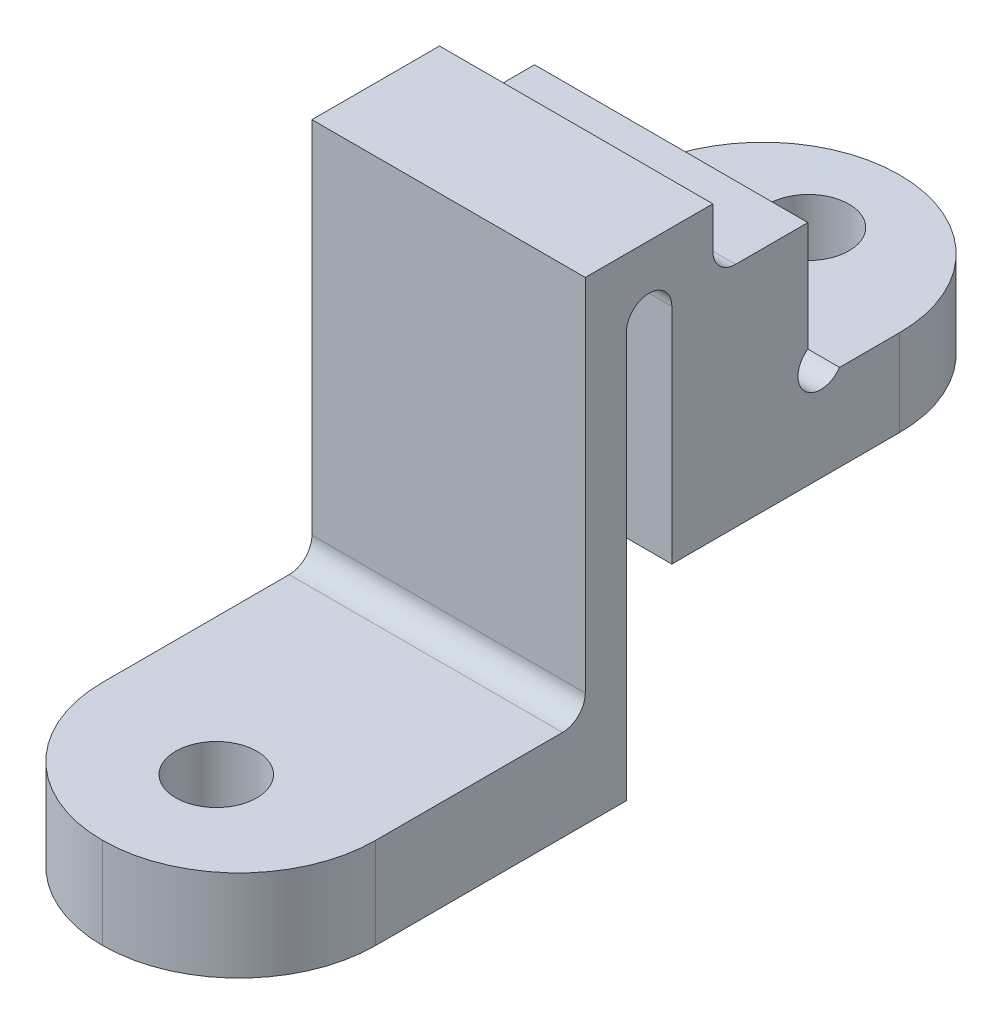
ISO-10303-21;
HEADER;
FILE_DESCRIPTION(('STEP AP214'),'2;1');
FILE_NAME('part.step','',(''),(''),'','','');
FILE_SCHEMA(('AUTOMOTIVE_DESIGN { 1 0 10303 214 1 1 1 1 }'));
ENDSEC;
DATA;
#1=APPLICATION_CONTEXT('core data for automotive mechanical design processes');
#2=APPLICATION_PROTOCOL_DEFINITION('international standard','automotive_design',2000,#1);
#3=PRODUCT_CONTEXT('',#1,'mechanical');
#4=PRODUCT('Part','Part','',(#3));
#5=PRODUCT_RELATED_PRODUCT_CATEGORY('part','',(#4));
#6=PRODUCT_DEFINITION_FORMATION('','',#4);
#7=PRODUCT_DEFINITION_CONTEXT('part definition',#1,'design');
#8=PRODUCT_DEFINITION('design','',#6,#7);
#9=PRODUCT_DEFINITION_SHAPE('','',#8);
#10=(LENGTH_UNIT() NAMED_UNIT(*) SI_UNIT(.MILLI.,.METRE.));
#11=(NAMED_UNIT(*) PLANE_ANGLE_UNIT() SI_UNIT($,.RADIAN.));
#12=(NAMED_UNIT(*) SI_UNIT($,.STERADIAN.) SOLID_ANGLE_UNIT());
#13=UNCERTAINTY_MEASURE_WITH_UNIT(LENGTH_MEASURE(1.E-05),#10,'distance_accuracy_value','');
#14=(GEOMETRIC_REPRESENTATION_CONTEXT(3) GLOBAL_UNCERTAINTY_ASSIGNED_CONTEXT((#13)) GLOBAL_UNIT_ASSIGNED_CONTEXT((#10,
#11,#12)) REPRESENTATION_CONTEXT('',''));
#15=CARTESIAN_POINT('',(0.,0.,0.));
#16=DIRECTION('',(0.,0.,1.));
#17=DIRECTION('',(1.,0.,0.));
#18=AXIS2_PLACEMENT_3D('',#15,#16,#17);
#19=CARTESIAN_POINT('',(1.5,10.597577098778,1.));
#20=DIRECTION('',(0.,-1.,0.));
#21=DIRECTION('',(0.,0.,-1.));
#22=AXIS2_PLACEMENT_3D('',#19,#20,#21);
#23=PLANE('',#22);
#24=CARTESIAN_POINT('',(4.5,10.597577098778,-5.));
#25=DIRECTION('',(0.,-1.,0.));
#26=DIRECTION('',(0.,0.,-1.));
#27=AXIS2_PLACEMENT_3D('',#24,#25,#26);
#28=CIRCLE('',#27,0.888999999999999);
#29=CARTESIAN_POINT('',(4.5,10.597577098778,-5.889));
#30=VERTEX_POINT('',#29);
#31=EDGE_CURVE('E487',#30,#30,#28,.T.);
#32=ORIENTED_EDGE('',*,*,#31,.F.);
#33=EDGE_LOOP('',(#32));
#34=FACE_BOUND('',#33,.T.);
#35=CARTESIAN_POINT('',(4.5,10.597577098778,-4.));
#36=DIRECTION('',(0.,-1.,0.));
#37=DIRECTION('',(0.,0.,-1.));
#38=AXIS2_PLACEMENT_3D('',#35,#36,#37);
#39=CIRCLE('',#38,3.);
#40=CARTESIAN_POINT('',(1.5,10.597577098778,-4.));
#41=VERTEX_POINT('',#40);
#42=CARTESIAN_POINT('',(4.5,10.597577098778,-7.));
#43=VERTEX_POINT('',#42);
#44=EDGE_CURVE('E315',#41,#43,#39,.T.);
#45=ORIENTED_EDGE('',*,*,#44,.T.);
#46=CARTESIAN_POINT('',(4.5,10.597577098778,-4.));
#47=DIRECTION('',(0.,-1.,0.));
#48=DIRECTION('',(0.,0.,-1.));
#49=AXIS2_PLACEMENT_3D('',#46,#47,#48);
#50=CIRCLE('',#49,3.);
#51=CARTESIAN_POINT('',(7.5,10.597577098778,-4.));
#52=VERTEX_POINT('',#51);
#53=EDGE_CURVE('E318',#43,#52,#50,.T.);
#54=ORIENTED_EDGE('',*,*,#53,.T.);
#55=DIRECTION('',(0.,0.,-1.));
#56=VECTOR('',#55,1.);
#57=CARTESIAN_POINT('',(7.5,10.597577098778,1.));
#58=LINE('',#57,#56);
#59=CARTESIAN_POINT('',(7.5,10.597577098778,1.));
#60=VERTEX_POINT('',#59);
#61=EDGE_CURVE('E244',#60,#52,#58,.T.);
#62=ORIENTED_EDGE('',*,*,#61,.F.);
#63=DIRECTION('',(1.,0.,0.));
#64=VECTOR('',#63,1.);
#65=CARTESIAN_POINT('',(1.5,10.597577098778,1.));
#66=LINE('',#65,#64);
#67=CARTESIAN_POINT('',(1.5,10.597577098778,1.));
#68=VERTEX_POINT('',#67);
#69=EDGE_CURVE('E285',#68,#60,#66,.T.);
#70=ORIENTED_EDGE('',*,*,#69,.F.);
#71=DIRECTION('',(0.,0.,-1.));
#72=VECTOR('',#71,1.);
#73=CARTESIAN_POINT('',(1.5,10.597577098778,1.));
#74=LINE('',#73,#72);
#75=EDGE_CURVE('E259',#68,#41,#74,.T.);
#76=ORIENTED_EDGE('',*,*,#75,.T.);
#77=EDGE_LOOP('',(#45,#54,#62,#70,#76));
#78=FACE_BOUND('',#77,.T.);
#79=ADVANCED_FACE('F45',(#34,#78),#23,.T.);
#80=CARTESIAN_POINT('',(1.5,10.597577098778,1.));
#81=DIRECTION('',(0.,0.,1.));
#82=DIRECTION('',(1.,0.,0.));
#83=AXIS2_PLACEMENT_3D('',#80,#81,#82);
#84=PLANE('',#83);
#85=DIRECTION('',(0.,-1.,0.));
#86=VECTOR('',#85,1.);
#87=CARTESIAN_POINT('',(7.5,10.597577098778,1.));
#88=LINE('',#87,#86);
#89=CARTESIAN_POINT('',(7.5,15.497577098778,1.));
#90=VERTEX_POINT('',#89);
#91=EDGE_CURVE('E278',#90,#60,#88,.T.);
#92=ORIENTED_EDGE('',*,*,#91,.F.);
#93=DIRECTION('',(1.,0.,0.));
#94=VECTOR('',#93,1.);
#95=CARTESIAN_POINT('',(1.5,15.497577098778,1.));
#96=LINE('',#95,#94);
#97=CARTESIAN_POINT('',(1.5,15.497577098778,1.));
#98=VERTEX_POINT('',#97);
#99=EDGE_CURVE('E289',#98,#90,#96,.T.);
#100=ORIENTED_EDGE('',*,*,#99,.F.);
#101=DIRECTION('',(0.,-1.,0.));
#102=VECTOR('',#101,1.);
#103=CARTESIAN_POINT('',(1.5,10.597577098778,1.));
#104=LINE('',#103,#102);
#105=EDGE_CURVE('E255',#98,#68,#104,.T.);
#106=ORIENTED_EDGE('',*,*,#105,.T.);
#107=ORIENTED_EDGE('',*,*,#69,.T.);
#108=EDGE_LOOP('',(#92,#100,#106,#107));
#109=FACE_BOUND('',#108,.T.);
#110=ADVANCED_FACE('F416',(#109),#84,.T.);
#111=CARTESIAN_POINT('',(1.5,15.497577098778,1.5));
#112=DIRECTION('',(1.,0.,0.));
#113=DIRECTION('',(0.,0.,-1.));
#114=AXIS2_PLACEMENT_3D('',#111,#112,#113);
#115=CYLINDRICAL_SURFACE('',#114,0.5);
#116=CARTESIAN_POINT('',(7.5,15.497577098778,1.5));
#117=DIRECTION('',(-1.,0.,0.));
#118=DIRECTION('',(0.,0.,1.));
#119=AXIS2_PLACEMENT_3D('',#116,#117,#118);
#120=CIRCLE('',#119,0.5);
#121=CARTESIAN_POINT('',(7.5,15.497577098778,2.));
#122=VERTEX_POINT('',#121);
#123=EDGE_CURVE('E274',#122,#90,#120,.T.);
#124=ORIENTED_EDGE('',*,*,#123,.F.);
#125=DIRECTION('',(1.,0.,0.));
#126=VECTOR('',#125,1.);
#127=CARTESIAN_POINT('',(1.5,15.497577098778,2.));
#128=LINE('',#127,#126);
#129=CARTESIAN_POINT('',(1.5,15.497577098778,2.));
#130=VERTEX_POINT('',#129);
#131=EDGE_CURVE('E292',#130,#122,#128,.T.);
#132=ORIENTED_EDGE('',*,*,#131,.F.);
#133=CARTESIAN_POINT('',(1.5,15.497577098778,1.5));
#134=DIRECTION('',(-1.,0.,0.));
#135=DIRECTION('',(0.,0.,1.));
#136=AXIS2_PLACEMENT_3D('',#133,#134,#135);
#137=CIRCLE('',#136,0.5);
#138=EDGE_CURVE('E251',#130,#98,#137,.T.);
#139=ORIENTED_EDGE('',*,*,#138,.T.);
#140=ORIENTED_EDGE('',*,*,#99,.T.);
#141=EDGE_LOOP('',(#124,#132,#139,#140));
#142=FACE_BOUND('',#141,.T.);
#143=ADVANCED_FACE('F422',(#142),#115,.F.);
#144=CARTESIAN_POINT('',(1.5,6.59757709877801,2.));
#145=DIRECTION('',(0.,0.,-1.));
#146=DIRECTION('',(-1.,0.,0.));
#147=AXIS2_PLACEMENT_3D('',#144,#145,#146);
#148=PLANE('',#147);
#149=DIRECTION('',(0.,1.,0.));
#150=VECTOR('',#149,1.);
#151=CARTESIAN_POINT('',(7.5,6.59757709877801,2.));
#152=LINE('',#151,#150);
#153=CARTESIAN_POINT('',(7.5,6.59757709877801,2.));
#154=VERTEX_POINT('',#153);
#155=EDGE_CURVE('E270',#154,#122,#152,.T.);
#156=ORIENTED_EDGE('',*,*,#155,.F.);
#157=DIRECTION('',(1.,0.,0.));
#158=VECTOR('',#157,1.);
#159=CARTESIAN_POINT('',(1.5,6.59757709877801,2.));
#160=LINE('',#159,#158);
#161=CARTESIAN_POINT('',(1.5,6.59757709877801,2.));
#162=VERTEX_POINT('',#161);
#163=EDGE_CURVE('E263',#162,#154,#160,.T.);
#164=ORIENTED_EDGE('',*,*,#163,.F.);
#165=DIRECTION('',(0.,1.,0.));
#166=VECTOR('',#165,1.);
#167=CARTESIAN_POINT('',(1.5,6.59757709877801,2.));
#168=LINE('',#167,#166);
#169=EDGE_CURVE('E247',#162,#130,#168,.T.);
#170=ORIENTED_EDGE('',*,*,#169,.T.);
#171=ORIENTED_EDGE('',*,*,#131,.T.);
#172=EDGE_LOOP('',(#156,#164,#170,#171));
#173=FACE_BOUND('',#172,.T.);
#174=ADVANCED_FACE('F432',(#173),#148,.T.);
#175=CARTESIAN_POINT('',(1.5,6.59757709877801,10.5));
#176=DIRECTION('',(0.,-1.,0.));
#177=DIRECTION('',(0.,0.,-1.));
#178=AXIS2_PLACEMENT_3D('',#175,#176,#177);
#179=PLANE('',#178);
#180=CARTESIAN_POINT('',(4.5,6.59757709877801,8.));
#181=DIRECTION('',(0.,1.,0.));
#182=DIRECTION('',(0.,0.,1.));
#183=AXIS2_PLACEMENT_3D('',#180,#181,#182);
#184=CIRCLE('',#183,0.888999999999999);
#185=CARTESIAN_POINT('',(4.5,6.59757709877801,8.889));
#186=VERTEX_POINT('',#185);
#187=EDGE_CURVE('E349',#186,#186,#184,.T.);
#188=ORIENTED_EDGE('',*,*,#187,.T.);
#189=EDGE_LOOP('',(#188));
#190=FACE_BOUND('',#189,.T.);
#191=CARTESIAN_POINT('',(4.5,6.59757709877801,7.5));
#192=DIRECTION('',(0.,-1.,0.));
#193=DIRECTION('',(0.,0.,-1.));
#194=AXIS2_PLACEMENT_3D('',#191,#192,#193);
#195=CIRCLE('',#194,3.);
#196=CARTESIAN_POINT('',(7.5,6.59757709877801,7.5));
#197=VERTEX_POINT('',#196);
#198=CARTESIAN_POINT('',(4.5,6.59757709877801,10.5));
#199=VERTEX_POINT('',#198);
#200=EDGE_CURVE('E328',#197,#199,#195,.T.);
#201=ORIENTED_EDGE('',*,*,#200,.T.);
#202=CARTESIAN_POINT('',(4.5,6.59757709877801,7.5));
#203=DIRECTION('',(0.,-1.,0.));
#204=DIRECTION('',(0.,0.,-1.));
#205=AXIS2_PLACEMENT_3D('',#202,#203,#204);
#206=CIRCLE('',#205,3.);
#207=CARTESIAN_POINT('',(1.5,6.59757709877801,7.5));
#208=VERTEX_POINT('',#207);
#209=EDGE_CURVE('E331',#199,#208,#206,.T.);
#210=ORIENTED_EDGE('',*,*,#209,.T.);
#211=DIRECTION('',(0.,0.,-1.));
#212=VECTOR('',#211,1.);
#213=CARTESIAN_POINT('',(1.5,6.59757709877801,10.5));
#214=LINE('',#213,#212);
#215=EDGE_CURVE('E243',#208,#162,#214,.T.);
#216=ORIENTED_EDGE('',*,*,#215,.T.);
#217=ORIENTED_EDGE('',*,*,#163,.T.);
#218=DIRECTION('',(0.,0.,-1.));
#219=VECTOR('',#218,1.);
#220=CARTESIAN_POINT('',(7.5,6.59757709877801,10.5));
#221=LINE('',#220,#219);
#222=EDGE_CURVE('E267',#197,#154,#221,.T.);
#223=ORIENTED_EDGE('',*,*,#222,.F.);
#224=EDGE_LOOP('',(#201,#210,#216,#217,#223));
#225=FACE_BOUND('',#224,.T.);
#226=ADVANCED_FACE('F436',(#190,#225),#179,.T.);
#227=CARTESIAN_POINT('',(1.5,16.997577098778,-7.));
#228=DIRECTION('',(0.,1.,0.));
#229=DIRECTION('',(0.,0.,1.));
#230=AXIS2_PLACEMENT_3D('',#227,#228,#229);
#231=PLANE('',#230);
#232=DIRECTION('',(-1.,0.,0.));
#233=VECTOR('',#232,1.);
#234=CARTESIAN_POINT('',(1.5,16.997577098778,2.9));
#235=LINE('',#234,#233);
#236=CARTESIAN_POINT('',(7.5,16.997577098778,2.9));
#237=VERTEX_POINT('',#236);
#238=CARTESIAN_POINT('',(1.5,16.997577098778,2.9));
#239=VERTEX_POINT('',#238);
#240=EDGE_CURVE('E235',#237,#239,#235,.T.);
#241=ORIENTED_EDGE('',*,*,#240,.F.);
#242=DIRECTION('',(0.,0.,1.));
#243=VECTOR('',#242,1.);
#244=CARTESIAN_POINT('',(7.5,16.997577098778,-7.));
#245=LINE('',#244,#243);
#246=CARTESIAN_POINT('',(7.5,16.997577098778,0.1));
#247=VERTEX_POINT('',#246);
#248=EDGE_CURVE('E238',#247,#237,#245,.T.);
#249=ORIENTED_EDGE('',*,*,#248,.F.);
#250=DIRECTION('',(1.,0.,0.));
#251=VECTOR('',#250,1.);
#252=CARTESIAN_POINT('',(1.5,16.997577098778,0.1));
#253=LINE('',#252,#251);
#254=CARTESIAN_POINT('',(1.5,16.997577098778,0.1));
#255=VERTEX_POINT('',#254);
#256=EDGE_CURVE('E220',#255,#247,#253,.T.);
#257=ORIENTED_EDGE('',*,*,#256,.F.);
#258=DIRECTION('',(0.,0.,1.));
#259=VECTOR('',#258,1.);
#260=CARTESIAN_POINT('',(1.5,16.997577098778,-7.));
#261=LINE('',#260,#259);
#262=EDGE_CURVE('E239',#255,#239,#261,.T.);
#263=ORIENTED_EDGE('',*,*,#262,.T.);
#264=EDGE_LOOP('',(#241,#249,#257,#263));
#265=FACE_BOUND('',#264,.T.);
#266=ADVANCED_FACE('F390',(#265),#231,.T.);
#267=CARTESIAN_POINT('',(1.5,15.497577098778,1.5));
#268=DIRECTION('',(-1.,0.,0.));
#269=DIRECTION('',(0.,0.,1.));
#270=AXIS2_PLACEMENT_3D('',#267,#268,#269);
#271=PLANE('',#270);
#272=CARTESIAN_POINT('',(1.5,12.7804198112526,-2.26914504299253));
#273=DIRECTION('',(1.,0.,0.));
#274=DIRECTION('',(0.,0.,-1.));
#275=AXIS2_PLACEMENT_3D('',#272,#273,#274);
#276=CIRCLE('',#275,0.5);
#277=CARTESIAN_POINT('',(1.5,13.1927303738144,-1.98630233051791));
#278=VERTEX_POINT('',#277);
#279=CARTESIAN_POINT('',(1.5,12.497577098778,-2.6814556055543));
#280=VERTEX_POINT('',#279);
#281=EDGE_CURVE('E178',#278,#280,#276,.T.);
#282=ORIENTED_EDGE('',*,*,#281,.T.);
#283=DIRECTION('',(0.,0.,1.));
#284=VECTOR('',#283,1.);
#285=CARTESIAN_POINT('',(1.5,12.497577098778,-1.98630233051791));
#286=LINE('',#285,#284);
#287=CARTESIAN_POINT('',(1.5,12.497577098778,-4.));
#288=VERTEX_POINT('',#287);
#289=EDGE_CURVE('E210',#288,#280,#286,.T.);
#290=ORIENTED_EDGE('',*,*,#289,.F.);
#291=DIRECTION('',(0.,1.,0.));
#292=VECTOR('',#291,1.);
#293=CARTESIAN_POINT('',(1.5,15.497577098778,-4.));
#294=LINE('',#293,#292);
#295=EDGE_CURVE('E325',#288,#41,#294,.F.);
#296=ORIENTED_EDGE('',*,*,#295,.T.);
#297=ORIENTED_EDGE('',*,*,#75,.F.);
#298=ORIENTED_EDGE('',*,*,#105,.F.);
#299=ORIENTED_EDGE('',*,*,#138,.F.);
#300=ORIENTED_EDGE('',*,*,#169,.F.);
#301=ORIENTED_EDGE('',*,*,#215,.F.);
#302=DIRECTION('',(0.,-1.,0.));
#303=VECTOR('',#302,1.);
#304=CARTESIAN_POINT('',(1.5,15.497577098778,7.5));
#305=LINE('',#304,#303);
#306=CARTESIAN_POINT('',(1.5,8.59757709877801,7.5));
#307=VERTEX_POINT('',#306);
#308=EDGE_CURVE('E321',#208,#307,#305,.F.);
#309=ORIENTED_EDGE('',*,*,#308,.T.);
#310=DIRECTION('',(0.,0.,1.));
#311=VECTOR('',#310,1.);
#312=CARTESIAN_POINT('',(1.5,8.59757709877801,2.9));
#313=LINE('',#312,#311);
#314=CARTESIAN_POINT('',(1.5,8.59757709877801,3.4));
#315=VERTEX_POINT('',#314);
#316=EDGE_CURVE('E204',#315,#307,#313,.T.);
#317=ORIENTED_EDGE('',*,*,#316,.F.);
#318=CARTESIAN_POINT('',(1.5,9.09757709877801,3.4));
#319=DIRECTION('',(-1.,0.,0.));
#320=DIRECTION('',(0.,0.,1.));
#321=AXIS2_PLACEMENT_3D('',#318,#319,#320);
#322=CIRCLE('',#321,0.5);
#323=CARTESIAN_POINT('',(1.5,9.09757709877801,2.9));
#324=VERTEX_POINT('',#323);
#325=EDGE_CURVE('E368',#315,#324,#322,.F.);
#326=ORIENTED_EDGE('',*,*,#325,.T.);
#327=DIRECTION('',(0.,-1.,0.));
#328=VECTOR('',#327,1.);
#329=CARTESIAN_POINT('',(1.5,20.497577098778,2.9));
#330=LINE('',#329,#328);
#331=EDGE_CURVE('E217',#239,#324,#330,.T.);
#332=ORIENTED_EDGE('',*,*,#331,.F.);
#333=ORIENTED_EDGE('',*,*,#262,.F.);
#334=DIRECTION('',(0.,1.,0.));
#335=VECTOR('',#334,1.);
#336=CARTESIAN_POINT('',(1.5,20.497577098778,0.1));
#337=LINE('',#336,#335);
#338=CARTESIAN_POINT('',(1.5,16.097577098778,0.1));
#339=VERTEX_POINT('',#338);
#340=EDGE_CURVE('E224',#339,#255,#337,.T.);
#341=ORIENTED_EDGE('',*,*,#340,.F.);
#342=CARTESIAN_POINT('',(1.5,16.097577098778,-0.4));
#343=DIRECTION('',(-1.,0.,0.));
#344=DIRECTION('',(0.,0.,1.));
#345=AXIS2_PLACEMENT_3D('',#342,#343,#344);
#346=CIRCLE('',#345,0.5);
#347=CARTESIAN_POINT('',(1.5,15.597577098778,-0.4));
#348=VERTEX_POINT('',#347);
#349=EDGE_CURVE('E362',#339,#348,#346,.F.);
#350=ORIENTED_EDGE('',*,*,#349,.T.);
#351=DIRECTION('',(0.,0.,1.));
#352=VECTOR('',#351,1.);
#353=CARTESIAN_POINT('',(1.5,15.597577098778,0.1));
#354=LINE('',#353,#352);
#355=CARTESIAN_POINT('',(1.5,15.597577098778,-1.98630233051791));
#356=VERTEX_POINT('',#355);
#357=EDGE_CURVE('E225',#356,#348,#354,.T.);
#358=ORIENTED_EDGE('',*,*,#357,.F.);
#359=DIRECTION('',(0.,1.,0.));
#360=VECTOR('',#359,1.);
#361=CARTESIAN_POINT('',(1.5,12.497577098778,-1.98630233051791));
#362=LINE('',#361,#360);
#363=EDGE_CURVE('E206',#278,#356,#362,.T.);
#364=ORIENTED_EDGE('',*,*,#363,.F.);
#365=EDGE_LOOP('',(#282,#290,#296,#297,#298,#299,#300,#301,#309,#317,#326,#332,#333,#341,#350,
#358,#364));
#366=FACE_BOUND('',#365,.T.);
#367=ADVANCED_FACE('F384',(#366),#271,.T.);
#368=CARTESIAN_POINT('',(7.5,15.497577098778,1.5));
#369=DIRECTION('',(-1.,0.,0.));
#370=DIRECTION('',(0.,0.,1.));
#371=AXIS2_PLACEMENT_3D('',#368,#369,#370);
#372=PLANE('',#371);
#373=DIRECTION('',(0.,0.,1.));
#374=VECTOR('',#373,1.);
#375=CARTESIAN_POINT('',(7.5,12.497577098778,-1.98630233051791));
#376=LINE('',#375,#374);
#377=CARTESIAN_POINT('',(7.5,12.497577098778,-4.));
#378=VERTEX_POINT('',#377);
#379=CARTESIAN_POINT('',(7.5,12.497577098778,-2.6814556055543));
#380=VERTEX_POINT('',#379);
#381=EDGE_CURVE('E193',#378,#380,#376,.T.);
#382=ORIENTED_EDGE('',*,*,#381,.T.);
#383=CARTESIAN_POINT('',(7.5,12.7804198112526,-2.26914504299253));
#384=DIRECTION('',(1.,0.,0.));
#385=DIRECTION('',(0.,0.,-1.));
#386=AXIS2_PLACEMENT_3D('',#383,#384,#385);
#387=CIRCLE('',#386,0.5);
#388=CARTESIAN_POINT('',(7.5,13.1927303738144,-1.98630233051791));
#389=VERTEX_POINT('',#388);
#390=EDGE_CURVE('E61',#389,#380,#387,.T.);
#391=ORIENTED_EDGE('',*,*,#390,.F.);
#392=DIRECTION('',(0.,1.,0.));
#393=VECTOR('',#392,1.);
#394=CARTESIAN_POINT('',(7.5,12.497577098778,-1.98630233051791));
#395=LINE('',#394,#393);
#396=CARTESIAN_POINT('',(7.5,15.597577098778,-1.98630233051791));
#397=VERTEX_POINT('',#396);
#398=EDGE_CURVE('E189',#389,#397,#395,.T.);
#399=ORIENTED_EDGE('',*,*,#398,.T.);
#400=DIRECTION('',(0.,0.,1.));
#401=VECTOR('',#400,1.);
#402=CARTESIAN_POINT('',(7.5,15.597577098778,1.5));
#403=LINE('',#402,#401);
#404=CARTESIAN_POINT('',(7.5,15.597577098778,-0.4));
#405=VERTEX_POINT('',#404);
#406=EDGE_CURVE('E288',#397,#405,#403,.T.);
#407=ORIENTED_EDGE('',*,*,#406,.T.);
#408=CARTESIAN_POINT('',(7.5,16.097577098778,-0.4));
#409=DIRECTION('',(-1.,0.,0.));
#410=DIRECTION('',(0.,0.,1.));
#411=AXIS2_PLACEMENT_3D('',#408,#409,#410);
#412=CIRCLE('',#411,0.5);
#413=CARTESIAN_POINT('',(7.5,16.097577098778,0.1));
#414=VERTEX_POINT('',#413);
#415=EDGE_CURVE('E365',#405,#414,#412,.T.);
#416=ORIENTED_EDGE('',*,*,#415,.T.);
#417=DIRECTION('',(0.,1.,0.));
#418=VECTOR('',#417,1.);
#419=CARTESIAN_POINT('',(7.5,20.497577098778,0.1));
#420=LINE('',#419,#418);
#421=EDGE_CURVE('E221',#414,#247,#420,.T.);
#422=ORIENTED_EDGE('',*,*,#421,.T.);
#423=ORIENTED_EDGE('',*,*,#248,.T.);
#424=DIRECTION('',(0.,-1.,0.));
#425=VECTOR('',#424,1.);
#426=CARTESIAN_POINT('',(7.5,15.497577098778,2.9));
#427=LINE('',#426,#425);
#428=CARTESIAN_POINT('',(7.5,9.09757709877801,2.9));
#429=VERTEX_POINT('',#428);
#430=EDGE_CURVE('E300',#237,#429,#427,.T.);
#431=ORIENTED_EDGE('',*,*,#430,.T.);
#432=CARTESIAN_POINT('',(7.5,9.09757709877801,3.4));
#433=DIRECTION('',(-1.,0.,0.));
#434=DIRECTION('',(0.,0.,1.));
#435=AXIS2_PLACEMENT_3D('',#432,#433,#434);
#436=CIRCLE('',#435,0.5);
#437=CARTESIAN_POINT('',(7.5,8.59757709877801,3.4));
#438=VERTEX_POINT('',#437);
#439=EDGE_CURVE('E54',#429,#438,#436,.T.);
#440=ORIENTED_EDGE('',*,*,#439,.T.);
#441=DIRECTION('',(0.,0.,1.));
#442=VECTOR('',#441,1.);
#443=CARTESIAN_POINT('',(7.5,8.59757709877801,2.9));
#444=LINE('',#443,#442);
#445=CARTESIAN_POINT('',(7.5,8.59757709877801,7.5));
#446=VERTEX_POINT('',#445);
#447=EDGE_CURVE('E229',#438,#446,#444,.T.);
#448=ORIENTED_EDGE('',*,*,#447,.T.);
#449=DIRECTION('',(0.,-1.,0.));
#450=VECTOR('',#449,1.);
#451=CARTESIAN_POINT('',(7.5,6.59757709877801,7.5));
#452=LINE('',#451,#450);
#453=EDGE_CURVE('E303',#446,#197,#452,.T.);
#454=ORIENTED_EDGE('',*,*,#453,.T.);
#455=ORIENTED_EDGE('',*,*,#222,.T.);
#456=ORIENTED_EDGE('',*,*,#155,.T.);
#457=ORIENTED_EDGE('',*,*,#123,.T.);
#458=ORIENTED_EDGE('',*,*,#91,.T.);
#459=ORIENTED_EDGE('',*,*,#61,.T.);
#460=DIRECTION('',(0.,1.,0.));
#461=VECTOR('',#460,1.);
#462=CARTESIAN_POINT('',(7.5,12.497577098778,-4.));
#463=LINE('',#462,#461);
#464=EDGE_CURVE('E306',#52,#378,#463,.T.);
#465=ORIENTED_EDGE('',*,*,#464,.T.);
#466=EDGE_LOOP('',(#382,#391,#399,#407,#416,#422,#423,#431,#440,#448,#454,#455,#456,#457,#458,
#459,#465));
#467=FACE_BOUND('',#466,.T.);
#468=ADVANCED_FACE('F187',(#467),#372,.F.);
#469=CARTESIAN_POINT('',(7.5,20.497577098778,0.1));
#470=DIRECTION('',(0.,0.,1.));
#471=DIRECTION('',(0.,-1.,0.));
#472=AXIS2_PLACEMENT_3D('',#469,#470,#471);
#473=PLANE('',#472);
#474=ORIENTED_EDGE('',*,*,#421,.F.);
#475=DIRECTION('',(-1.,0.,0.));
#476=VECTOR('',#475,1.);
#477=CARTESIAN_POINT('',(1.5,16.097577098778,0.1));
#478=LINE('',#477,#476);
#479=EDGE_CURVE('E341',#414,#339,#478,.T.);
#480=ORIENTED_EDGE('',*,*,#479,.T.);
#481=ORIENTED_EDGE('',*,*,#340,.T.);
#482=ORIENTED_EDGE('',*,*,#256,.T.);
#483=EDGE_LOOP('',(#474,#480,#481,#482));
#484=FACE_BOUND('',#483,.T.);
#485=ADVANCED_FACE('F396',(#484),#473,.F.);
#486=CARTESIAN_POINT('',(7.5,15.597577098778,0.1));
#487=DIRECTION('',(0.,-1.,0.));
#488=DIRECTION('',(0.,0.,-1.));
#489=AXIS2_PLACEMENT_3D('',#486,#487,#488);
#490=PLANE('',#489);
#491=ORIENTED_EDGE('',*,*,#357,.T.);
#492=DIRECTION('',(-1.,0.,0.));
#493=VECTOR('',#492,1.);
#494=CARTESIAN_POINT('',(7.5,15.597577098778,-0.4));
#495=LINE('',#494,#493);
#496=EDGE_CURVE('E353',#348,#405,#495,.F.);
#497=ORIENTED_EDGE('',*,*,#496,.T.);
#498=ORIENTED_EDGE('',*,*,#406,.F.);
#499=DIRECTION('',(-1.,0.,0.));
#500=VECTOR('',#499,1.);
#501=CARTESIAN_POINT('',(7.5,15.597577098778,-1.98630233051791));
#502=LINE('',#501,#500);
#503=EDGE_CURVE('E198',#397,#356,#502,.T.);
#504=ORIENTED_EDGE('',*,*,#503,.T.);
#505=EDGE_LOOP('',(#491,#497,#498,#504));
#506=FACE_BOUND('',#505,.T.);
#507=ADVANCED_FACE('F402',(#506),#490,.F.);
#508=CARTESIAN_POINT('',(7.5,20.497577098778,2.9));
#509=DIRECTION('',(0.,0.,-1.));
#510=DIRECTION('',(0.,1.,0.));
#511=AXIS2_PLACEMENT_3D('',#508,#509,#510);
#512=PLANE('',#511);
#513=ORIENTED_EDGE('',*,*,#331,.T.);
#514=DIRECTION('',(-1.,0.,0.));
#515=VECTOR('',#514,1.);
#516=CARTESIAN_POINT('',(7.5,9.09757709877801,2.9));
#517=LINE('',#516,#515);
#518=EDGE_CURVE('E68',#324,#429,#517,.F.);
#519=ORIENTED_EDGE('',*,*,#518,.T.);
#520=ORIENTED_EDGE('',*,*,#430,.F.);
#521=ORIENTED_EDGE('',*,*,#240,.T.);
#522=EDGE_LOOP('',(#513,#519,#520,#521));
#523=FACE_BOUND('',#522,.T.);
#524=ADVANCED_FACE('F386',(#523),#512,.F.);
#525=CARTESIAN_POINT('',(7.5,8.59757709877801,2.9));
#526=DIRECTION('',(0.,-1.,0.));
#527=DIRECTION('',(0.,0.,-1.));
#528=AXIS2_PLACEMENT_3D('',#525,#526,#527);
#529=PLANE('',#528);
#530=CARTESIAN_POINT('',(4.5,8.59757709877801,8.));
#531=DIRECTION('',(0.,1.,0.));
#532=DIRECTION('',(0.,0.,1.));
#533=AXIS2_PLACEMENT_3D('',#530,#531,#532);
#534=CIRCLE('',#533,0.889);
#535=CARTESIAN_POINT('',(4.5,8.59757709877801,8.889));
#536=VERTEX_POINT('',#535);
#537=EDGE_CURVE('E491',#536,#536,#534,.T.);
#538=ORIENTED_EDGE('',*,*,#537,.F.);
#539=EDGE_LOOP('',(#538));
#540=FACE_BOUND('',#539,.T.);
#541=ORIENTED_EDGE('',*,*,#447,.F.);
#542=DIRECTION('',(-1.,0.,0.));
#543=VECTOR('',#542,1.);
#544=CARTESIAN_POINT('',(1.5,8.59757709877801,3.4));
#545=LINE('',#544,#543);
#546=EDGE_CURVE('E356',#438,#315,#545,.T.);
#547=ORIENTED_EDGE('',*,*,#546,.T.);
#548=ORIENTED_EDGE('',*,*,#316,.T.);
#549=CARTESIAN_POINT('',(4.5,8.59757709877801,7.5));
#550=DIRECTION('',(0.,-1.,0.));
#551=DIRECTION('',(0.,0.,-1.));
#552=AXIS2_PLACEMENT_3D('',#549,#550,#551);
#553=CIRCLE('',#552,3.);
#554=CARTESIAN_POINT('',(4.5,8.59757709877801,10.5));
#555=VERTEX_POINT('',#554);
#556=EDGE_CURVE('E338',#307,#555,#553,.F.);
#557=ORIENTED_EDGE('',*,*,#556,.T.);
#558=CARTESIAN_POINT('',(4.5,8.59757709877801,7.5));
#559=DIRECTION('',(0.,-1.,0.));
#560=DIRECTION('',(0.,0.,-1.));
#561=AXIS2_PLACEMENT_3D('',#558,#559,#560);
#562=CIRCLE('',#561,3.);
#563=EDGE_CURVE('E334',#555,#446,#562,.F.);
#564=ORIENTED_EDGE('',*,*,#563,.T.);
#565=EDGE_LOOP('',(#541,#547,#548,#557,#564));
#566=FACE_BOUND('',#565,.T.);
#567=ADVANCED_FACE('F376',(#540,#566),#529,.F.);
#568=CARTESIAN_POINT('',(7.5,12.497577098778,-1.98630233051791));
#569=DIRECTION('',(0.,0.,1.));
#570=DIRECTION('',(0.,-1.,0.));
#571=AXIS2_PLACEMENT_3D('',#568,#569,#570);
#572=PLANE('',#571);
#573=ORIENTED_EDGE('',*,*,#398,.F.);
#574=DIRECTION('',(1.,0.,0.));
#575=VECTOR('',#574,1.);
#576=CARTESIAN_POINT('',(1.5,13.1927303738144,-1.98630233051791));
#577=LINE('',#576,#575);
#578=EDGE_CURVE('E175',#389,#278,#577,.F.);
#579=ORIENTED_EDGE('',*,*,#578,.T.);
#580=ORIENTED_EDGE('',*,*,#363,.T.);
#581=ORIENTED_EDGE('',*,*,#503,.F.);
#582=EDGE_LOOP('',(#573,#579,#580,#581));
#583=FACE_BOUND('',#582,.T.);
#584=ADVANCED_FACE('F196',(#583),#572,.F.);
#585=CARTESIAN_POINT('',(7.5,12.497577098778,-1.98630233051791));
#586=DIRECTION('',(0.,-1.,0.));
#587=DIRECTION('',(0.,0.,-1.));
#588=AXIS2_PLACEMENT_3D('',#585,#586,#587);
#589=PLANE('',#588);
#590=CARTESIAN_POINT('',(4.5,12.497577098778,-5.));
#591=DIRECTION('',(0.,1.,0.));
#592=DIRECTION('',(0.,0.,1.));
#593=AXIS2_PLACEMENT_3D('',#590,#591,#592);
#594=CIRCLE('',#593,0.888999999999999);
#595=CARTESIAN_POINT('',(4.5,12.497577098778,-4.111));
#596=VERTEX_POINT('',#595);
#597=EDGE_CURVE('E183',#596,#596,#594,.T.);
#598=ORIENTED_EDGE('',*,*,#597,.F.);
#599=EDGE_LOOP('',(#598));
#600=FACE_BOUND('',#599,.T.);
#601=ORIENTED_EDGE('',*,*,#289,.T.);
#602=DIRECTION('',(1.,0.,0.));
#603=VECTOR('',#602,1.);
#604=CARTESIAN_POINT('',(1.5,12.497577098778,-2.6814556055543));
#605=LINE('',#604,#603);
#606=EDGE_CURVE('E11',#280,#380,#605,.T.);
#607=ORIENTED_EDGE('',*,*,#606,.T.);
#608=ORIENTED_EDGE('',*,*,#381,.F.);
#609=CARTESIAN_POINT('',(4.5,12.497577098778,-4.));
#610=DIRECTION('',(0.,-1.,0.));
#611=DIRECTION('',(0.,0.,-1.));
#612=AXIS2_PLACEMENT_3D('',#609,#610,#611);
#613=CIRCLE('',#612,3.);
#614=CARTESIAN_POINT('',(4.5,12.497577098778,-7.));
#615=VERTEX_POINT('',#614);
#616=EDGE_CURVE('E312',#378,#615,#613,.F.);
#617=ORIENTED_EDGE('',*,*,#616,.T.);
#618=CARTESIAN_POINT('',(4.5,12.497577098778,-4.));
#619=DIRECTION('',(0.,-1.,0.));
#620=DIRECTION('',(0.,0.,-1.));
#621=AXIS2_PLACEMENT_3D('',#618,#619,#620);
#622=CIRCLE('',#621,3.);
#623=EDGE_CURVE('E309',#615,#288,#622,.F.);
#624=ORIENTED_EDGE('',*,*,#623,.T.);
#625=EDGE_LOOP('',(#601,#607,#608,#617,#624));
#626=FACE_BOUND('',#625,.T.);
#627=ADVANCED_FACE('F451',(#600,#626),#589,.F.);
#628=CARTESIAN_POINT('',(4.5,10.597577098778,-4.));
#629=DIRECTION('',(0.,1.,0.));
#630=DIRECTION('',(0.,0.,1.));
#631=AXIS2_PLACEMENT_3D('',#628,#629,#630);
#632=CYLINDRICAL_SURFACE('',#631,3.);
#633=DIRECTION('',(0.,1.,0.));
#634=VECTOR('',#633,1.);
#635=CARTESIAN_POINT('',(4.5,10.597577098778,-7.));
#636=LINE('',#635,#634);
#637=EDGE_CURVE('E214',#43,#615,#636,.T.);
#638=ORIENTED_EDGE('',*,*,#637,.F.);
#639=ORIENTED_EDGE('',*,*,#44,.F.);
#640=ORIENTED_EDGE('',*,*,#295,.F.);
#641=ORIENTED_EDGE('',*,*,#623,.F.);
#642=EDGE_LOOP('',(#638,#639,#640,#641));
#643=FACE_BOUND('',#642,.T.);
#644=ADVANCED_FACE('F447',(#643),#632,.T.);
#645=CARTESIAN_POINT('',(4.5,15.497577098778,-4.));
#646=DIRECTION('',(0.,-1.,0.));
#647=DIRECTION('',(0.,0.,-1.));
#648=AXIS2_PLACEMENT_3D('',#645,#646,#647);
#649=CYLINDRICAL_SURFACE('',#648,3.);
#650=ORIENTED_EDGE('',*,*,#53,.F.);
#651=ORIENTED_EDGE('',*,*,#637,.T.);
#652=ORIENTED_EDGE('',*,*,#616,.F.);
#653=ORIENTED_EDGE('',*,*,#464,.F.);
#654=EDGE_LOOP('',(#650,#651,#652,#653));
#655=FACE_BOUND('',#654,.T.);
#656=ADVANCED_FACE('F443',(#655),#649,.T.);
#657=CARTESIAN_POINT('',(4.5,15.497577098778,7.5));
#658=DIRECTION('',(0.,1.,0.));
#659=DIRECTION('',(0.,0.,1.));
#660=AXIS2_PLACEMENT_3D('',#657,#658,#659);
#661=CYLINDRICAL_SURFACE('',#660,3.);
#662=ORIENTED_EDGE('',*,*,#453,.F.);
#663=ORIENTED_EDGE('',*,*,#563,.F.);
#664=DIRECTION('',(0.,-1.,0.));
#665=VECTOR('',#664,1.);
#666=CARTESIAN_POINT('',(4.5,8.59757709877801,10.5));
#667=LINE('',#666,#665);
#668=EDGE_CURVE('E345',#199,#555,#667,.F.);
#669=ORIENTED_EDGE('',*,*,#668,.F.);
#670=ORIENTED_EDGE('',*,*,#200,.F.);
#671=EDGE_LOOP('',(#662,#663,#669,#670));
#672=FACE_BOUND('',#671,.T.);
#673=ADVANCED_FACE('F446',(#672),#661,.T.);
#674=CARTESIAN_POINT('',(4.5,16.997577098778,7.5));
#675=DIRECTION('',(0.,-1.,0.));
#676=DIRECTION('',(0.,0.,-1.));
#677=AXIS2_PLACEMENT_3D('',#674,#675,#676);
#678=CYLINDRICAL_SURFACE('',#677,3.);
#679=ORIENTED_EDGE('',*,*,#556,.F.);
#680=ORIENTED_EDGE('',*,*,#308,.F.);
#681=ORIENTED_EDGE('',*,*,#209,.F.);
#682=ORIENTED_EDGE('',*,*,#668,.T.);
#683=EDGE_LOOP('',(#679,#680,#681,#682));
#684=FACE_BOUND('',#683,.T.);
#685=ADVANCED_FACE('F411',(#684),#678,.T.);
#686=CARTESIAN_POINT('',(4.5,8.59757709877801,8.));
#687=DIRECTION('',(0.,1.,0.));
#688=DIRECTION('',(0.,0.,1.));
#689=AXIS2_PLACEMENT_3D('',#686,#687,#688);
#690=CYLINDRICAL_SURFACE('',#689,0.889);
#691=ORIENTED_EDGE('',*,*,#187,.F.);
#692=EDGE_LOOP('',(#691));
#693=FACE_BOUND('',#692,.T.);
#694=ORIENTED_EDGE('',*,*,#537,.T.);
#695=EDGE_LOOP('',(#694));
#696=FACE_BOUND('',#695,.T.);
#697=ADVANCED_FACE('F405',(#693,#696),#690,.F.);
#698=CARTESIAN_POINT('',(7.5,16.097577098778,-0.4));
#699=DIRECTION('',(1.,0.,0.));
#700=DIRECTION('',(0.,0.,-1.));
#701=AXIS2_PLACEMENT_3D('',#698,#699,#700);
#702=CYLINDRICAL_SURFACE('',#701,0.5);
#703=ORIENTED_EDGE('',*,*,#415,.F.);
#704=ORIENTED_EDGE('',*,*,#496,.F.);
#705=ORIENTED_EDGE('',*,*,#349,.F.);
#706=ORIENTED_EDGE('',*,*,#479,.F.);
#707=EDGE_LOOP('',(#703,#704,#705,#706));
#708=FACE_BOUND('',#707,.T.);
#709=ADVANCED_FACE('F403',(#708),#702,.F.);
#710=CARTESIAN_POINT('',(7.5,9.09757709877801,3.4));
#711=DIRECTION('',(1.,0.,0.));
#712=DIRECTION('',(0.,0.,-1.));
#713=AXIS2_PLACEMENT_3D('',#710,#711,#712);
#714=CYLINDRICAL_SURFACE('',#713,0.5);
#715=ORIENTED_EDGE('',*,*,#439,.F.);
#716=ORIENTED_EDGE('',*,*,#518,.F.);
#717=ORIENTED_EDGE('',*,*,#325,.F.);
#718=ORIENTED_EDGE('',*,*,#546,.F.);
#719=EDGE_LOOP('',(#715,#716,#717,#718));
#720=FACE_BOUND('',#719,.T.);
#721=ADVANCED_FACE('F47',(#720),#714,.F.);
#722=CARTESIAN_POINT('',(4.5,12.497577098778,-5.));
#723=DIRECTION('',(0.,1.,0.));
#724=DIRECTION('',(0.,0.,1.));
#725=AXIS2_PLACEMENT_3D('',#722,#723,#724);
#726=CYLINDRICAL_SURFACE('',#725,0.888999999999999);
#727=ORIENTED_EDGE('',*,*,#31,.T.);
#728=EDGE_LOOP('',(#727));
#729=FACE_BOUND('',#728,.T.);
#730=ORIENTED_EDGE('',*,*,#597,.T.);
#731=EDGE_LOOP('',(#730));
#732=FACE_BOUND('',#731,.T.);
#733=ADVANCED_FACE('F410',(#729,#732),#726,.F.);
#734=CARTESIAN_POINT('',(1.5,12.7804198112526,-2.26914504299253));
#735=DIRECTION('',(1.,0.,0.));
#736=DIRECTION('',(0.,0.,-1.));
#737=AXIS2_PLACEMENT_3D('',#734,#735,#736);
#738=CYLINDRICAL_SURFACE('',#737,0.5);
#739=ORIENTED_EDGE('',*,*,#390,.T.);
#740=ORIENTED_EDGE('',*,*,#606,.F.);
#741=ORIENTED_EDGE('',*,*,#281,.F.);
#742=ORIENTED_EDGE('',*,*,#578,.F.);
#743=EDGE_LOOP('',(#739,#740,#741,#742));
#744=FACE_BOUND('',#743,.T.);
#745=ADVANCED_FACE('F176',(#744),#738,.F.);
#746=CLOSED_SHELL('',(#79,#110,#143,#174,#226,#266,#367,#468,#485,#507,#524,#567,#584,#627,#644,
#656,#673,#685,#697,#709,#721,#733,#745));
#747=MANIFOLD_SOLID_BREP('B2',#746);
#748=ADVANCED_BREP_SHAPE_REPRESENTATION('',(#18,#747),#14);
#749=SHAPE_DEFINITION_REPRESENTATION(#9,#748);
ENDSEC;
END-ISO-10303-21;
